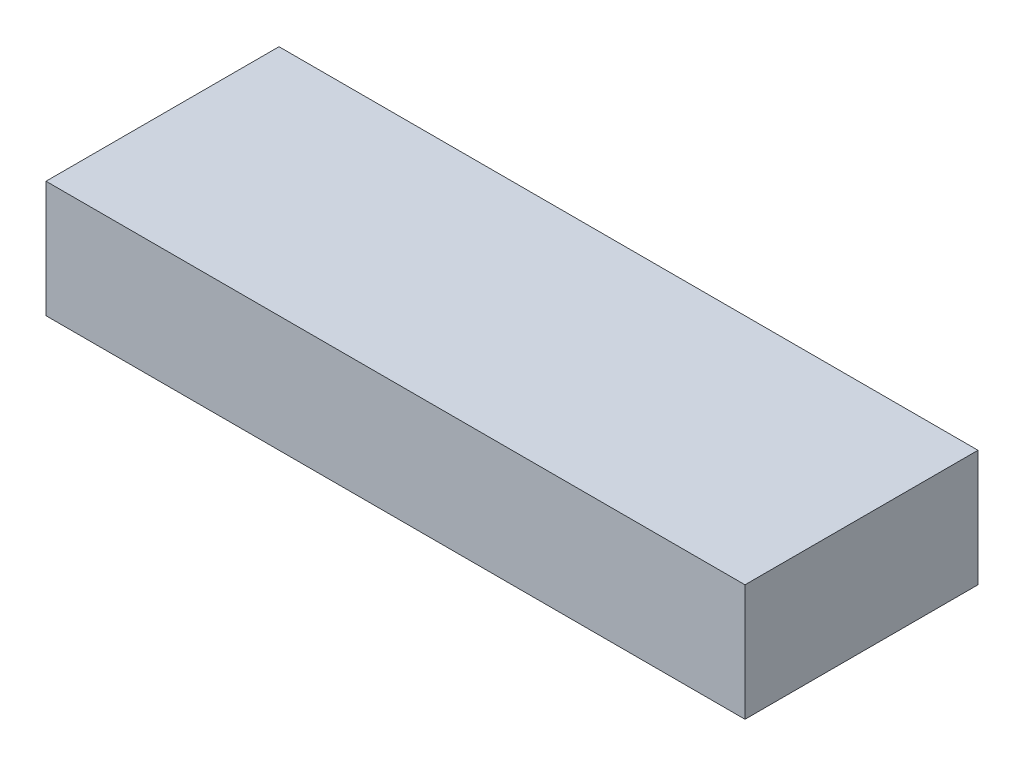
ISO-10303-21;
HEADER;
FILE_DESCRIPTION(('STEP AP214'),'2;1');
FILE_NAME('part.step','',(''),(''),'','','');
FILE_SCHEMA(('AUTOMOTIVE_DESIGN { 1 0 10303 214 1 1 1 1 }'));
ENDSEC;
DATA;
#1=APPLICATION_CONTEXT('core data for automotive mechanical design processes');
#2=APPLICATION_PROTOCOL_DEFINITION('international standard','automotive_design',2000,#1);
#3=PRODUCT_CONTEXT('',#1,'mechanical');
#4=PRODUCT('Part','Part','',(#3));
#5=PRODUCT_RELATED_PRODUCT_CATEGORY('part','',(#4));
#6=PRODUCT_DEFINITION_FORMATION('','',#4);
#7=PRODUCT_DEFINITION_CONTEXT('part definition',#1,'design');
#8=PRODUCT_DEFINITION('design','',#6,#7);
#9=PRODUCT_DEFINITION_SHAPE('','',#8);
#10=(LENGTH_UNIT() NAMED_UNIT(*) SI_UNIT(.MILLI.,.METRE.));
#11=(NAMED_UNIT(*) PLANE_ANGLE_UNIT() SI_UNIT($,.RADIAN.));
#12=(NAMED_UNIT(*) SI_UNIT($,.STERADIAN.) SOLID_ANGLE_UNIT());
#13=UNCERTAINTY_MEASURE_WITH_UNIT(LENGTH_MEASURE(1.E-05),#10,'distance_accuracy_value','');
#14=(GEOMETRIC_REPRESENTATION_CONTEXT(3) GLOBAL_UNCERTAINTY_ASSIGNED_CONTEXT((#13)) GLOBAL_UNIT_ASSIGNED_CONTEXT((#10,
#11,#12)) REPRESENTATION_CONTEXT('',''));
#15=CARTESIAN_POINT('',(0.,0.,0.));
#16=DIRECTION('',(0.,0.,1.));
#17=DIRECTION('',(1.,0.,0.));
#18=AXIS2_PLACEMENT_3D('',#15,#16,#17);
#19=CARTESIAN_POINT('',(-19.05,3.175,-6.35));
#20=DIRECTION('',(1.,0.,0.));
#21=DIRECTION('',(0.,0.,-1.));
#22=AXIS2_PLACEMENT_3D('',#19,#20,#21);
#23=PLANE('',#22);
#24=DIRECTION('',(0.,0.,1.));
#25=VECTOR('',#24,1.);
#26=CARTESIAN_POINT('',(-19.05,-3.175,-6.35));
#27=LINE('',#26,#25);
#28=CARTESIAN_POINT('',(-19.05,-3.175,-6.35));
#29=VERTEX_POINT('',#28);
#30=CARTESIAN_POINT('',(-19.05,-3.175,6.35));
#31=VERTEX_POINT('',#30);
#32=EDGE_CURVE('E97',#29,#31,#27,.T.);
#33=ORIENTED_EDGE('',*,*,#32,.T.);
#34=DIRECTION('',(0.,-1.,0.));
#35=VECTOR('',#34,1.);
#36=CARTESIAN_POINT('',(-19.05,3.175,6.35));
#37=LINE('',#36,#35);
#38=CARTESIAN_POINT('',(-19.05,3.175,6.35));
#39=VERTEX_POINT('',#38);
#40=EDGE_CURVE('E11',#39,#31,#37,.T.);
#41=ORIENTED_EDGE('',*,*,#40,.F.);
#42=DIRECTION('',(0.,0.,1.));
#43=VECTOR('',#42,1.);
#44=CARTESIAN_POINT('',(-19.05,3.175,-6.35));
#45=LINE('',#44,#43);
#46=CARTESIAN_POINT('',(-19.05,3.175,-6.35));
#47=VERTEX_POINT('',#46);
#48=EDGE_CURVE('E85',#47,#39,#45,.T.);
#49=ORIENTED_EDGE('',*,*,#48,.F.);
#50=DIRECTION('',(0.,-1.,0.));
#51=VECTOR('',#50,1.);
#52=CARTESIAN_POINT('',(-19.05,3.175,-6.35));
#53=LINE('',#52,#51);
#54=EDGE_CURVE('E93',#47,#29,#53,.T.);
#55=ORIENTED_EDGE('',*,*,#54,.T.);
#56=EDGE_LOOP('',(#33,#41,#49,#55));
#57=FACE_BOUND('',#56,.T.);
#58=ADVANCED_FACE('F34',(#57),#23,.F.);
#59=CARTESIAN_POINT('',(19.05,3.175,6.35));
#60=DIRECTION('',(0.,0.,-1.));
#61=DIRECTION('',(-1.,0.,0.));
#62=AXIS2_PLACEMENT_3D('',#59,#60,#61);
#63=PLANE('',#62);
#64=DIRECTION('',(1.,0.,0.));
#65=VECTOR('',#64,1.);
#66=CARTESIAN_POINT('',(19.05,-3.175,6.35));
#67=LINE('',#66,#65);
#68=CARTESIAN_POINT('',(19.05,-3.175,6.35));
#69=VERTEX_POINT('',#68);
#70=EDGE_CURVE('E89',#31,#69,#67,.T.);
#71=ORIENTED_EDGE('',*,*,#70,.T.);
#72=DIRECTION('',(0.,-1.,0.));
#73=VECTOR('',#72,1.);
#74=CARTESIAN_POINT('',(19.05,3.175,6.35));
#75=LINE('',#74,#73);
#76=CARTESIAN_POINT('',(19.05,3.175,6.35));
#77=VERTEX_POINT('',#76);
#78=EDGE_CURVE('E42',#77,#69,#75,.T.);
#79=ORIENTED_EDGE('',*,*,#78,.F.);
#80=DIRECTION('',(1.,0.,0.));
#81=VECTOR('',#80,1.);
#82=CARTESIAN_POINT('',(19.05,3.175,6.35));
#83=LINE('',#82,#81);
#84=EDGE_CURVE('E80',#39,#77,#83,.T.);
#85=ORIENTED_EDGE('',*,*,#84,.F.);
#86=ORIENTED_EDGE('',*,*,#40,.T.);
#87=EDGE_LOOP('',(#71,#79,#85,#86));
#88=FACE_BOUND('',#87,.T.);
#89=ADVANCED_FACE('F88',(#88),#63,.F.);
#90=CARTESIAN_POINT('',(19.05,3.175,-6.35));
#91=DIRECTION('',(-1.,0.,0.));
#92=DIRECTION('',(0.,0.,1.));
#93=AXIS2_PLACEMENT_3D('',#90,#91,#92);
#94=PLANE('',#93);
#95=DIRECTION('',(0.,0.,-1.));
#96=VECTOR('',#95,1.);
#97=CARTESIAN_POINT('',(19.05,-3.175,-6.35));
#98=LINE('',#97,#96);
#99=CARTESIAN_POINT('',(19.05,-3.175,-6.35));
#100=VERTEX_POINT('',#99);
#101=EDGE_CURVE('E67',#69,#100,#98,.T.);
#102=ORIENTED_EDGE('',*,*,#101,.T.);
#103=DIRECTION('',(0.,-1.,0.));
#104=VECTOR('',#103,1.);
#105=CARTESIAN_POINT('',(19.05,3.175,-6.35));
#106=LINE('',#105,#104);
#107=CARTESIAN_POINT('',(19.05,3.175,-6.35));
#108=VERTEX_POINT('',#107);
#109=EDGE_CURVE('E90',#108,#100,#106,.T.);
#110=ORIENTED_EDGE('',*,*,#109,.F.);
#111=DIRECTION('',(0.,0.,-1.));
#112=VECTOR('',#111,1.);
#113=CARTESIAN_POINT('',(19.05,3.175,-6.35));
#114=LINE('',#113,#112);
#115=EDGE_CURVE('E83',#77,#108,#114,.T.);
#116=ORIENTED_EDGE('',*,*,#115,.F.);
#117=ORIENTED_EDGE('',*,*,#78,.T.);
#118=EDGE_LOOP('',(#102,#110,#116,#117));
#119=FACE_BOUND('',#118,.T.);
#120=ADVANCED_FACE('F91',(#119),#94,.F.);
#121=CARTESIAN_POINT('',(19.05,3.175,-6.35));
#122=DIRECTION('',(0.,0.,1.));
#123=DIRECTION('',(1.,0.,0.));
#124=AXIS2_PLACEMENT_3D('',#121,#122,#123);
#125=PLANE('',#124);
#126=DIRECTION('',(-1.,0.,0.));
#127=VECTOR('',#126,1.);
#128=CARTESIAN_POINT('',(19.05,-3.175,-6.35));
#129=LINE('',#128,#127);
#130=EDGE_CURVE('E73',#100,#29,#129,.T.);
#131=ORIENTED_EDGE('',*,*,#130,.T.);
#132=ORIENTED_EDGE('',*,*,#54,.F.);
#133=DIRECTION('',(-1.,0.,0.));
#134=VECTOR('',#133,1.);
#135=CARTESIAN_POINT('',(19.05,3.175,-6.35));
#136=LINE('',#135,#134);
#137=EDGE_CURVE('E50',#108,#47,#136,.T.);
#138=ORIENTED_EDGE('',*,*,#137,.F.);
#139=ORIENTED_EDGE('',*,*,#109,.T.);
#140=EDGE_LOOP('',(#131,#132,#138,#139));
#141=FACE_BOUND('',#140,.T.);
#142=ADVANCED_FACE('F104',(#141),#125,.F.);
#143=CARTESIAN_POINT('',(-19.05,3.175,6.35));
#144=DIRECTION('',(0.,-1.,0.));
#145=DIRECTION('',(0.,0.,-1.));
#146=AXIS2_PLACEMENT_3D('',#143,#144,#145);
#147=PLANE('',#146);
#148=ORIENTED_EDGE('',*,*,#48,.T.);
#149=ORIENTED_EDGE('',*,*,#84,.T.);
#150=ORIENTED_EDGE('',*,*,#115,.T.);
#151=ORIENTED_EDGE('',*,*,#137,.T.);
#152=EDGE_LOOP('',(#148,#149,#150,#151));
#153=FACE_BOUND('',#152,.T.);
#154=ADVANCED_FACE('F81',(#153),#147,.F.);
#155=CARTESIAN_POINT('',(-19.05,-3.175,6.35));
#156=DIRECTION('',(0.,-1.,0.));
#157=DIRECTION('',(0.,0.,-1.));
#158=AXIS2_PLACEMENT_3D('',#155,#156,#157);
#159=PLANE('',#158);
#160=ORIENTED_EDGE('',*,*,#32,.F.);
#161=ORIENTED_EDGE('',*,*,#130,.F.);
#162=ORIENTED_EDGE('',*,*,#101,.F.);
#163=ORIENTED_EDGE('',*,*,#70,.F.);
#164=EDGE_LOOP('',(#160,#161,#162,#163));
#165=FACE_BOUND('',#164,.T.);
#166=ADVANCED_FACE('F107',(#165),#159,.T.);
#167=CLOSED_SHELL('',(#58,#89,#120,#142,#154,#166));
#168=MANIFOLD_SOLID_BREP('B2',#167);
#169=ADVANCED_BREP_SHAPE_REPRESENTATION('',(#18,#168),#14);
#170=SHAPE_DEFINITION_REPRESENTATION(#9,#169);
ENDSEC;
END-ISO-10303-21;
